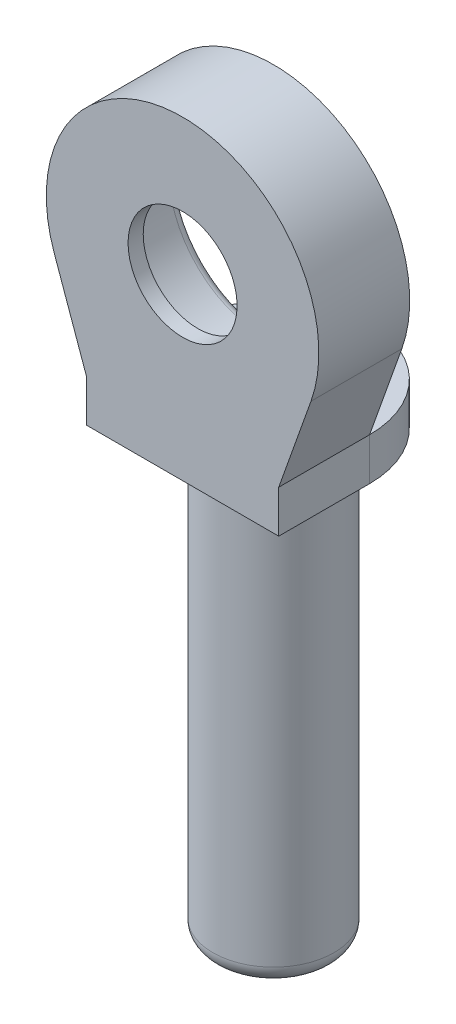
ISO-10303-21;
HEADER;
FILE_DESCRIPTION(('STEP AP214'),'2;1');
FILE_NAME('part.step','',(''),(''),'','','');
FILE_SCHEMA(('AUTOMOTIVE_DESIGN { 1 0 10303 214 1 1 1 1 }'));
ENDSEC;
DATA;
#1=APPLICATION_CONTEXT('core data for automotive mechanical design processes');
#2=APPLICATION_PROTOCOL_DEFINITION('international standard','automotive_design',2000,#1);
#3=PRODUCT_CONTEXT('',#1,'mechanical');
#4=PRODUCT('Part','Part','',(#3));
#5=PRODUCT_RELATED_PRODUCT_CATEGORY('part','',(#4));
#6=PRODUCT_DEFINITION_FORMATION('','',#4);
#7=PRODUCT_DEFINITION_CONTEXT('part definition',#1,'design');
#8=PRODUCT_DEFINITION('design','',#6,#7);
#9=PRODUCT_DEFINITION_SHAPE('','',#8);
#10=(LENGTH_UNIT() NAMED_UNIT(*) SI_UNIT(.MILLI.,.METRE.));
#11=(NAMED_UNIT(*) PLANE_ANGLE_UNIT() SI_UNIT($,.RADIAN.));
#12=(NAMED_UNIT(*) SI_UNIT($,.STERADIAN.) SOLID_ANGLE_UNIT());
#13=UNCERTAINTY_MEASURE_WITH_UNIT(LENGTH_MEASURE(1.E-05),#10,'distance_accuracy_value','');
#14=(GEOMETRIC_REPRESENTATION_CONTEXT(3) GLOBAL_UNCERTAINTY_ASSIGNED_CONTEXT((#13)) GLOBAL_UNIT_ASSIGNED_CONTEXT((#10,
#11,#12)) REPRESENTATION_CONTEXT('',''));
#15=CARTESIAN_POINT('',(0.,0.,0.));
#16=DIRECTION('',(0.,0.,1.));
#17=DIRECTION('',(1.,0.,0.));
#18=AXIS2_PLACEMENT_3D('',#15,#16,#17);
#19=CARTESIAN_POINT('',(-3.175,14.6,-9.5486743108979));
#20=DIRECTION('',(0.,-1.,0.));
#21=DIRECTION('',(0.,0.,-1.));
#22=AXIS2_PLACEMENT_3D('',#19,#20,#21);
#23=PLANE('',#22);
#24=DIRECTION('',(-1.,0.,0.));
#25=VECTOR('',#24,1.);
#26=CARTESIAN_POINT('',(-3.175,14.6,0.5));
#27=LINE('',#26,#25);
#28=CARTESIAN_POINT('',(1.3076696830622,14.6,0.5));
#29=VERTEX_POINT('',#28);
#30=CARTESIAN_POINT('',(-1.3076696830622,14.6,0.5));
#31=VERTEX_POINT('',#30);
#32=EDGE_CURVE('E124',#29,#31,#27,.T.);
#33=ORIENTED_EDGE('',*,*,#32,.T.);
#34=CARTESIAN_POINT('',(0.,14.6,0.));
#35=DIRECTION('',(0.,-1.,0.));
#36=DIRECTION('',(0.,0.,-1.));
#37=AXIS2_PLACEMENT_3D('',#34,#35,#36);
#38=CIRCLE('',#37,1.4);
#39=CARTESIAN_POINT('',(-1.4,14.6,0.));
#40=VERTEX_POINT('',#39);
#41=EDGE_CURVE('E215',#31,#40,#38,.T.);
#42=ORIENTED_EDGE('',*,*,#41,.T.);
#43=DIRECTION('',(1.,0.,0.));
#44=VECTOR('',#43,1.);
#45=CARTESIAN_POINT('',(-3.175,14.6,0.));
#46=LINE('',#45,#44);
#47=CARTESIAN_POINT('',(1.4,14.6,0.));
#48=VERTEX_POINT('',#47);
#49=EDGE_CURVE('E170',#40,#48,#46,.T.);
#50=ORIENTED_EDGE('',*,*,#49,.T.);
#51=EDGE_CURVE('E212',#48,#29,#38,.T.);
#52=ORIENTED_EDGE('',*,*,#51,.T.);
#53=EDGE_LOOP('',(#33,#42,#50,#52));
#54=FACE_BOUND('',#53,.T.);
#55=ADVANCED_FACE('F34',(#54),#23,.T.);
#56=CARTESIAN_POINT('',(0.,20.5,3.));
#57=DIRECTION('',(0.,0.,-1.));
#58=DIRECTION('',(-1.,0.,0.));
#59=AXIS2_PLACEMENT_3D('',#56,#57,#58);
#60=CYLINDRICAL_SURFACE('',#59,4.5);
#61=CARTESIAN_POINT('',(0.,20.5,3.));
#62=DIRECTION('',(0.,0.,1.));
#63=DIRECTION('',(-1.,0.,0.));
#64=AXIS2_PLACEMENT_3D('',#61,#62,#63);
#65=CIRCLE('',#64,4.5);
#66=CARTESIAN_POINT('',(4.23952688083414,18.9912217436996,3.));
#67=VERTEX_POINT('',#66);
#68=CARTESIAN_POINT('',(-4.23952688083414,18.9912217436996,3.));
#69=VERTEX_POINT('',#68);
#70=EDGE_CURVE('E49',#67,#69,#65,.T.);
#71=ORIENTED_EDGE('',*,*,#70,.F.);
#72=DIRECTION('',(0.,0.,1.));
#73=VECTOR('',#72,1.);
#74=CARTESIAN_POINT('',(4.23952688083414,18.9912217436996,-9.5486743108979));
#75=LINE('',#74,#73);
#76=CARTESIAN_POINT('',(4.23952688083414,18.9912217436996,0.));
#77=VERTEX_POINT('',#76);
#78=EDGE_CURVE('E195',#77,#67,#75,.T.);
#79=ORIENTED_EDGE('',*,*,#78,.F.);
#80=CARTESIAN_POINT('',(0.,20.5,0.));
#81=DIRECTION('',(0.,0.,1.));
#82=DIRECTION('',(1.,0.,0.));
#83=AXIS2_PLACEMENT_3D('',#80,#81,#82);
#84=CIRCLE('',#83,4.5);
#85=CARTESIAN_POINT('',(-4.23952688083414,18.9912217436996,0.));
#86=VERTEX_POINT('',#85);
#87=EDGE_CURVE('E210',#77,#86,#84,.T.);
#88=ORIENTED_EDGE('',*,*,#87,.T.);
#89=DIRECTION('',(0.,0.,1.));
#90=VECTOR('',#89,1.);
#91=CARTESIAN_POINT('',(-4.23952688083414,18.9912217436996,-9.5486743108979));
#92=LINE('',#91,#90);
#93=EDGE_CURVE('E54',#86,#69,#92,.T.);
#94=ORIENTED_EDGE('',*,*,#93,.T.);
#95=EDGE_LOOP('',(#71,#79,#88,#94));
#96=FACE_BOUND('',#95,.T.);
#97=ADVANCED_FACE('F241',(#96),#60,.T.);
#98=CARTESIAN_POINT('',(0.,20.5,3.));
#99=DIRECTION('',(0.,0.,-1.));
#100=DIRECTION('',(-1.,0.,0.));
#101=AXIS2_PLACEMENT_3D('',#98,#99,#100);
#102=PLANE('',#101);
#103=DIRECTION('',(1.,0.,0.));
#104=VECTOR('',#103,1.);
#105=CARTESIAN_POINT('',(-3.175,14.6,3.));
#106=LINE('',#105,#104);
#107=CARTESIAN_POINT('',(-3.175,14.6,3.));
#108=VERTEX_POINT('',#107);
#109=CARTESIAN_POINT('',(3.175,14.6,3.));
#110=VERTEX_POINT('',#109);
#111=EDGE_CURVE('E177',#108,#110,#106,.T.);
#112=ORIENTED_EDGE('',*,*,#111,.T.);
#113=DIRECTION('',(0.,1.,0.));
#114=VECTOR('',#113,1.);
#115=CARTESIAN_POINT('',(3.175,14.6,3.));
#116=LINE('',#115,#114);
#117=CARTESIAN_POINT('',(3.175,16.,3.));
#118=VERTEX_POINT('',#117);
#119=EDGE_CURVE('E174',#110,#118,#116,.T.);
#120=ORIENTED_EDGE('',*,*,#119,.T.);
#121=DIRECTION('',(0.335284056955635,0.942117084629809,0.));
#122=VECTOR('',#121,1.);
#123=CARTESIAN_POINT('',(3.175,16.,3.));
#124=LINE('',#123,#122);
#125=EDGE_CURVE('E171',#118,#67,#124,.T.);
#126=ORIENTED_EDGE('',*,*,#125,.T.);
#127=ORIENTED_EDGE('',*,*,#70,.T.);
#128=DIRECTION('',(0.335284056955635,-0.942117084629809,0.));
#129=VECTOR('',#128,1.);
#130=CARTESIAN_POINT('',(-3.175,16.,3.));
#131=LINE('',#130,#129);
#132=CARTESIAN_POINT('',(-3.175,16.,3.));
#133=VERTEX_POINT('',#132);
#134=EDGE_CURVE('E167',#69,#133,#131,.T.);
#135=ORIENTED_EDGE('',*,*,#134,.T.);
#136=DIRECTION('',(0.,-1.,0.));
#137=VECTOR('',#136,1.);
#138=CARTESIAN_POINT('',(-3.175,16.,3.));
#139=LINE('',#138,#137);
#140=EDGE_CURVE('E166',#133,#108,#139,.T.);
#141=ORIENTED_EDGE('',*,*,#140,.T.);
#142=EDGE_LOOP('',(#112,#120,#126,#127,#135,#141));
#143=FACE_BOUND('',#142,.T.);
#144=CARTESIAN_POINT('',(0.,20.5,3.));
#145=DIRECTION('',(0.,0.,-1.));
#146=DIRECTION('',(-1.,0.,0.));
#147=AXIS2_PLACEMENT_3D('',#144,#145,#146);
#148=CIRCLE('',#147,1.8);
#149=CARTESIAN_POINT('',(-1.8,20.5,3.));
#150=VERTEX_POINT('',#149);
#151=EDGE_CURVE('E128',#150,#150,#148,.F.);
#152=ORIENTED_EDGE('',*,*,#151,.F.);
#153=EDGE_LOOP('',(#152));
#154=FACE_BOUND('',#153,.T.);
#155=ADVANCED_FACE('F248',(#143,#154),#102,.F.);
#156=CARTESIAN_POINT('',(0.,20.5,0.));
#157=DIRECTION('',(0.,0.,-1.));
#158=DIRECTION('',(-1.,0.,0.));
#159=AXIS2_PLACEMENT_3D('',#156,#157,#158);
#160=PLANE('',#159);
#161=CARTESIAN_POINT('',(0.,20.5,0.));
#162=DIRECTION('',(0.,0.,-1.));
#163=DIRECTION('',(-1.,0.,0.));
#164=AXIS2_PLACEMENT_3D('',#161,#162,#163);
#165=CIRCLE('',#164,3.45);
#166=CARTESIAN_POINT('',(-3.45,20.5,0.));
#167=VERTEX_POINT('',#166);
#168=EDGE_CURVE('E11',#167,#167,#165,.F.);
#169=ORIENTED_EDGE('',*,*,#168,.T.);
#170=EDGE_LOOP('',(#169));
#171=FACE_BOUND('',#170,.T.);
#172=DIRECTION('',(1.,0.,0.));
#173=VECTOR('',#172,1.);
#174=CARTESIAN_POINT('',(0.,16.,0.));
#175=LINE('',#174,#173);
#176=CARTESIAN_POINT('',(-3.175,16.,0.));
#177=VERTEX_POINT('',#176);
#178=CARTESIAN_POINT('',(-2.4,16.,0.));
#179=VERTEX_POINT('',#178);
#180=EDGE_CURVE('E159',#177,#179,#175,.T.);
#181=ORIENTED_EDGE('',*,*,#180,.F.);
#182=DIRECTION('',(0.335284056955635,-0.942117084629809,0.));
#183=VECTOR('',#182,1.);
#184=CARTESIAN_POINT('',(-3.175,16.,0.));
#185=LINE('',#184,#183);
#186=EDGE_CURVE('E189',#86,#177,#185,.T.);
#187=ORIENTED_EDGE('',*,*,#186,.F.);
#188=ORIENTED_EDGE('',*,*,#87,.F.);
#189=DIRECTION('',(0.335284056955635,0.942117084629809,0.));
#190=VECTOR('',#189,1.);
#191=CARTESIAN_POINT('',(3.175,16.,0.));
#192=LINE('',#191,#190);
#193=CARTESIAN_POINT('',(3.175,16.,0.));
#194=VERTEX_POINT('',#193);
#195=EDGE_CURVE('E192',#194,#77,#192,.T.);
#196=ORIENTED_EDGE('',*,*,#195,.F.);
#197=CARTESIAN_POINT('',(2.4,16.,0.));
#198=VERTEX_POINT('',#197);
#199=EDGE_CURVE('E157',#198,#194,#175,.T.);
#200=ORIENTED_EDGE('',*,*,#199,.F.);
#201=CARTESIAN_POINT('',(2.4,15.,0.));
#202=DIRECTION('',(0.,0.,-1.));
#203=DIRECTION('',(-1.,0.,0.));
#204=AXIS2_PLACEMENT_3D('',#201,#202,#203);
#205=CIRCLE('',#204,1.);
#206=CARTESIAN_POINT('',(1.4,15.,0.));
#207=VERTEX_POINT('',#206);
#208=EDGE_CURVE('E217',#207,#198,#205,.T.);
#209=ORIENTED_EDGE('',*,*,#208,.F.);
#210=DIRECTION('',(0.,-1.,0.));
#211=VECTOR('',#210,1.);
#212=CARTESIAN_POINT('',(1.4,25.,0.));
#213=LINE('',#212,#211);
#214=EDGE_CURVE('E160',#207,#48,#213,.T.);
#215=ORIENTED_EDGE('',*,*,#214,.T.);
#216=ORIENTED_EDGE('',*,*,#49,.F.);
#217=DIRECTION('',(0.,-1.,0.));
#218=VECTOR('',#217,1.);
#219=CARTESIAN_POINT('',(-1.4,25.,0.));
#220=LINE('',#219,#218);
#221=CARTESIAN_POINT('',(-1.4,15.,0.));
#222=VERTEX_POINT('',#221);
#223=EDGE_CURVE('E163',#40,#222,#220,.F.);
#224=ORIENTED_EDGE('',*,*,#223,.T.);
#225=CARTESIAN_POINT('',(-2.4,15.,0.));
#226=DIRECTION('',(0.,0.,-1.));
#227=DIRECTION('',(-1.,0.,0.));
#228=AXIS2_PLACEMENT_3D('',#225,#226,#227);
#229=CIRCLE('',#228,1.);
#230=EDGE_CURVE('E219',#179,#222,#229,.T.);
#231=ORIENTED_EDGE('',*,*,#230,.F.);
#232=EDGE_LOOP('',(#181,#187,#188,#196,#200,#209,#215,#216,#224,#231));
#233=FACE_BOUND('',#232,.T.);
#234=ADVANCED_FACE('F317',(#171,#233),#160,.T.);
#235=CARTESIAN_POINT('',(0.,20.5,2.5));
#236=DIRECTION('',(0.,0.,-1.));
#237=DIRECTION('',(-1.,0.,0.));
#238=AXIS2_PLACEMENT_3D('',#235,#236,#237);
#239=CYLINDRICAL_SURFACE('',#238,3.15);
#240=CARTESIAN_POINT('',(0.,20.5,0.3));
#241=DIRECTION('',(0.,0.,-1.));
#242=DIRECTION('',(-1.,0.,0.));
#243=AXIS2_PLACEMENT_3D('',#240,#241,#242);
#244=CIRCLE('',#243,3.15);
#245=CARTESIAN_POINT('',(-3.15,20.5,0.3));
#246=VERTEX_POINT('',#245);
#247=EDGE_CURVE('E42',#246,#246,#244,.T.);
#248=ORIENTED_EDGE('',*,*,#247,.T.);
#249=EDGE_LOOP('',(#248));
#250=FACE_BOUND('',#249,.T.);
#251=CARTESIAN_POINT('',(0.,20.5,2.5));
#252=DIRECTION('',(0.,0.,-1.));
#253=DIRECTION('',(-1.,0.,0.));
#254=AXIS2_PLACEMENT_3D('',#251,#252,#253);
#255=CIRCLE('',#254,3.15);
#256=CARTESIAN_POINT('',(-3.15,20.5,2.5));
#257=VERTEX_POINT('',#256);
#258=EDGE_CURVE('E207',#257,#257,#255,.T.);
#259=ORIENTED_EDGE('',*,*,#258,.F.);
#260=EDGE_LOOP('',(#259));
#261=FACE_BOUND('',#260,.T.);
#262=ADVANCED_FACE('F223',(#250,#261),#239,.F.);
#263=CARTESIAN_POINT('',(0.,20.5,2.5));
#264=DIRECTION('',(0.,0.,-1.));
#265=DIRECTION('',(-1.,0.,0.));
#266=AXIS2_PLACEMENT_3D('',#263,#264,#265);
#267=PLANE('',#266);
#268=CARTESIAN_POINT('',(0.,20.5,2.5));
#269=DIRECTION('',(0.,0.,-1.));
#270=DIRECTION('',(-1.,0.,0.));
#271=AXIS2_PLACEMENT_3D('',#268,#269,#270);
#272=CIRCLE('',#271,1.8);
#273=CARTESIAN_POINT('',(-1.8,20.5,2.5));
#274=VERTEX_POINT('',#273);
#275=EDGE_CURVE('E310',#274,#274,#272,.T.);
#276=ORIENTED_EDGE('',*,*,#275,.F.);
#277=EDGE_LOOP('',(#276));
#278=FACE_BOUND('',#277,.T.);
#279=ORIENTED_EDGE('',*,*,#258,.T.);
#280=EDGE_LOOP('',(#279));
#281=FACE_BOUND('',#280,.T.);
#282=ADVANCED_FACE('F253',(#278,#281),#267,.T.);
#283=DIRECTION('',(0.,0.,1.));
#284=VECTOR('',#283,1.);
#285=CARTESIAN_POINT('',(3.175,14.6,-9.5486743108979));
#286=LINE('',#285,#284);
#287=CARTESIAN_POINT('',(3.175,14.6,0.));
#288=VERTEX_POINT('',#287);
#289=EDGE_CURVE('E183',#288,#110,#286,.T.);
#290=ORIENTED_EDGE('',*,*,#289,.T.);
#291=ORIENTED_EDGE('',*,*,#111,.F.);
#292=DIRECTION('',(0.,0.,1.));
#293=VECTOR('',#292,1.);
#294=CARTESIAN_POINT('',(-3.175,14.6,-9.5486743108979));
#295=LINE('',#294,#293);
#296=CARTESIAN_POINT('',(-3.175,14.6,0.));
#297=VERTEX_POINT('',#296);
#298=EDGE_CURVE('E187',#297,#108,#295,.T.);
#299=ORIENTED_EDGE('',*,*,#298,.F.);
#300=CARTESIAN_POINT('',(0.,14.6,0.));
#301=DIRECTION('',(0.,1.,0.));
#302=DIRECTION('',(0.,0.,1.));
#303=AXIS2_PLACEMENT_3D('',#300,#301,#302);
#304=CIRCLE('',#303,3.175);
#305=EDGE_CURVE('E147',#288,#297,#304,.T.);
#306=ORIENTED_EDGE('',*,*,#305,.F.);
#307=EDGE_LOOP('',(#290,#291,#299,#306));
#308=FACE_BOUND('',#307,.T.);
#309=CARTESIAN_POINT('',(0.,14.6,0.));
#310=DIRECTION('',(0.,1.,0.));
#311=DIRECTION('',(0.,0.,1.));
#312=AXIS2_PLACEMENT_3D('',#309,#310,#311);
#313=CIRCLE('',#312,2.);
#314=CARTESIAN_POINT('',(0.,14.6,2.));
#315=VERTEX_POINT('',#314);
#316=EDGE_CURVE('E135',#315,#315,#313,.T.);
#317=ORIENTED_EDGE('',*,*,#316,.T.);
#318=EDGE_LOOP('',(#317));
#319=FACE_BOUND('',#318,.T.);
#320=ADVANCED_FACE('F244',(#308,#319),#23,.T.);
#321=CARTESIAN_POINT('',(3.175,14.6,-9.5486743108979));
#322=DIRECTION('',(1.,0.,0.));
#323=DIRECTION('',(0.,0.,-1.));
#324=AXIS2_PLACEMENT_3D('',#321,#322,#323);
#325=PLANE('',#324);
#326=ORIENTED_EDGE('',*,*,#289,.F.);
#327=DIRECTION('',(0.,1.,0.));
#328=VECTOR('',#327,1.);
#329=CARTESIAN_POINT('',(3.175,14.6,0.));
#330=LINE('',#329,#328);
#331=EDGE_CURVE('E197',#288,#194,#330,.T.);
#332=ORIENTED_EDGE('',*,*,#331,.T.);
#333=DIRECTION('',(0.,0.,1.));
#334=VECTOR('',#333,1.);
#335=CARTESIAN_POINT('',(3.175,16.,-9.5486743108979));
#336=LINE('',#335,#334);
#337=EDGE_CURVE('E196',#194,#118,#336,.T.);
#338=ORIENTED_EDGE('',*,*,#337,.T.);
#339=ORIENTED_EDGE('',*,*,#119,.F.);
#340=EDGE_LOOP('',(#326,#332,#338,#339));
#341=FACE_BOUND('',#340,.T.);
#342=ADVANCED_FACE('F252',(#341),#325,.T.);
#343=CARTESIAN_POINT('',(3.175,16.,-9.5486743108979));
#344=DIRECTION('',(0.942117084629809,-0.335284056955635,0.));
#345=DIRECTION('',(0.335284056955635,0.942117084629809,0.));
#346=AXIS2_PLACEMENT_3D('',#343,#344,#345);
#347=PLANE('',#346);
#348=ORIENTED_EDGE('',*,*,#337,.F.);
#349=ORIENTED_EDGE('',*,*,#195,.T.);
#350=ORIENTED_EDGE('',*,*,#78,.T.);
#351=ORIENTED_EDGE('',*,*,#125,.F.);
#352=EDGE_LOOP('',(#348,#349,#350,#351));
#353=FACE_BOUND('',#352,.T.);
#354=ADVANCED_FACE('F259',(#353),#347,.T.);
#355=CARTESIAN_POINT('',(-3.175,16.,-9.5486743108979));
#356=DIRECTION('',(-0.942117084629809,-0.335284056955635,0.));
#357=DIRECTION('',(0.335284056955635,-0.942117084629809,0.));
#358=AXIS2_PLACEMENT_3D('',#355,#356,#357);
#359=PLANE('',#358);
#360=ORIENTED_EDGE('',*,*,#93,.F.);
#361=ORIENTED_EDGE('',*,*,#186,.T.);
#362=DIRECTION('',(0.,0.,1.));
#363=VECTOR('',#362,1.);
#364=CARTESIAN_POINT('',(-3.175,16.,-9.5486743108979));
#365=LINE('',#364,#363);
#366=EDGE_CURVE('E188',#177,#133,#365,.T.);
#367=ORIENTED_EDGE('',*,*,#366,.T.);
#368=ORIENTED_EDGE('',*,*,#134,.F.);
#369=EDGE_LOOP('',(#360,#361,#367,#368));
#370=FACE_BOUND('',#369,.T.);
#371=ADVANCED_FACE('F289',(#370),#359,.T.);
#372=CARTESIAN_POINT('',(-3.175,16.,-9.5486743108979));
#373=DIRECTION('',(-1.,0.,0.));
#374=DIRECTION('',(0.,0.,1.));
#375=AXIS2_PLACEMENT_3D('',#372,#373,#374);
#376=PLANE('',#375);
#377=ORIENTED_EDGE('',*,*,#366,.F.);
#378=DIRECTION('',(0.,-1.,0.));
#379=VECTOR('',#378,1.);
#380=CARTESIAN_POINT('',(-3.175,16.,0.));
#381=LINE('',#380,#379);
#382=EDGE_CURVE('E184',#177,#297,#381,.T.);
#383=ORIENTED_EDGE('',*,*,#382,.T.);
#384=ORIENTED_EDGE('',*,*,#298,.T.);
#385=ORIENTED_EDGE('',*,*,#140,.F.);
#386=EDGE_LOOP('',(#377,#383,#384,#385));
#387=FACE_BOUND('',#386,.T.);
#388=ADVANCED_FACE('F285',(#387),#376,.T.);
#389=CARTESIAN_POINT('',(0.,15.,0.));
#390=DIRECTION('',(0.,1.,0.));
#391=DIRECTION('',(0.,0.,1.));
#392=AXIS2_PLACEMENT_3D('',#389,#390,#391);
#393=TOROIDAL_SURFACE('',#392,2.4,1.);
#394=CARTESIAN_POINT('',(0.,16.,0.));
#395=DIRECTION('',(0.,1.,0.));
#396=DIRECTION('',(0.,0.,1.));
#397=AXIS2_PLACEMENT_3D('',#394,#395,#396);
#398=CIRCLE('',#397,2.4);
#399=EDGE_CURVE('E154',#179,#198,#398,.F.);
#400=ORIENTED_EDGE('',*,*,#399,.F.);
#401=ORIENTED_EDGE('',*,*,#230,.T.);
#402=CARTESIAN_POINT('',(0.,15.,0.));
#403=DIRECTION('',(0.,1.,0.));
#404=DIRECTION('',(0.,0.,1.));
#405=AXIS2_PLACEMENT_3D('',#402,#403,#404);
#406=CIRCLE('',#405,1.4);
#407=EDGE_CURVE('E151',#207,#222,#406,.T.);
#408=ORIENTED_EDGE('',*,*,#407,.F.);
#409=ORIENTED_EDGE('',*,*,#208,.T.);
#410=EDGE_LOOP('',(#400,#401,#408,#409));
#411=FACE_BOUND('',#410,.T.);
#412=ADVANCED_FACE('F282',(#411),#393,.T.);
#413=CARTESIAN_POINT('',(0.,25.,0.));
#414=DIRECTION('',(0.,-1.,0.));
#415=DIRECTION('',(0.,0.,-1.));
#416=AXIS2_PLACEMENT_3D('',#413,#414,#415);
#417=CYLINDRICAL_SURFACE('',#416,1.4);
#418=ORIENTED_EDGE('',*,*,#223,.F.);
#419=ORIENTED_EDGE('',*,*,#41,.F.);
#420=DIRECTION('',(0.,-1.,0.));
#421=VECTOR('',#420,1.);
#422=CARTESIAN_POINT('',(-1.3076696830622,25.,0.5));
#423=LINE('',#422,#421);
#424=CARTESIAN_POINT('',(-1.3076696830622,0.,0.5));
#425=VERTEX_POINT('',#424);
#426=EDGE_CURVE('E127',#31,#425,#423,.T.);
#427=ORIENTED_EDGE('',*,*,#426,.T.);
#428=CARTESIAN_POINT('',(0.,0.,0.));
#429=DIRECTION('',(0.,-1.,0.));
#430=DIRECTION('',(0.,0.,-1.));
#431=AXIS2_PLACEMENT_3D('',#428,#429,#430);
#432=CIRCLE('',#431,1.4);
#433=CARTESIAN_POINT('',(1.3076696830622,0.,0.5));
#434=VERTEX_POINT('',#433);
#435=EDGE_CURVE('E131',#425,#434,#432,.T.);
#436=ORIENTED_EDGE('',*,*,#435,.T.);
#437=DIRECTION('',(0.,-1.,0.));
#438=VECTOR('',#437,1.);
#439=CARTESIAN_POINT('',(1.3076696830622,25.,0.5));
#440=LINE('',#439,#438);
#441=EDGE_CURVE('E116',#29,#434,#440,.T.);
#442=ORIENTED_EDGE('',*,*,#441,.F.);
#443=ORIENTED_EDGE('',*,*,#51,.F.);
#444=ORIENTED_EDGE('',*,*,#214,.F.);
#445=ORIENTED_EDGE('',*,*,#407,.T.);
#446=EDGE_LOOP('',(#418,#419,#427,#436,#442,#443,#444,#445));
#447=FACE_BOUND('',#446,.T.);
#448=ADVANCED_FACE('F132',(#447),#417,.F.);
#449=CARTESIAN_POINT('',(-1.3076696830622,25.,0.5));
#450=DIRECTION('',(0.,0.,1.));
#451=DIRECTION('',(1.,0.,0.));
#452=AXIS2_PLACEMENT_3D('',#449,#450,#451);
#453=PLANE('',#452);
#454=ORIENTED_EDGE('',*,*,#32,.F.);
#455=ORIENTED_EDGE('',*,*,#441,.T.);
#456=DIRECTION('',(1.,0.,0.));
#457=VECTOR('',#456,1.);
#458=CARTESIAN_POINT('',(-1.3076696830622,0.,0.5));
#459=LINE('',#458,#457);
#460=EDGE_CURVE('E121',#434,#425,#459,.F.);
#461=ORIENTED_EDGE('',*,*,#460,.T.);
#462=ORIENTED_EDGE('',*,*,#426,.F.);
#463=EDGE_LOOP('',(#454,#455,#461,#462));
#464=FACE_BOUND('',#463,.T.);
#465=ADVANCED_FACE('F118',(#464),#453,.F.);
#466=CARTESIAN_POINT('',(0.,16.,0.));
#467=DIRECTION('',(0.,1.,0.));
#468=DIRECTION('',(0.,0.,1.));
#469=AXIS2_PLACEMENT_3D('',#466,#467,#468);
#470=PLANE('',#469);
#471=CARTESIAN_POINT('',(0.,16.,0.));
#472=DIRECTION('',(0.,1.,0.));
#473=DIRECTION('',(0.,0.,1.));
#474=AXIS2_PLACEMENT_3D('',#471,#472,#473);
#475=CIRCLE('',#474,3.175);
#476=EDGE_CURVE('E140',#194,#177,#475,.T.);
#477=ORIENTED_EDGE('',*,*,#476,.T.);
#478=ORIENTED_EDGE('',*,*,#180,.T.);
#479=ORIENTED_EDGE('',*,*,#399,.T.);
#480=ORIENTED_EDGE('',*,*,#199,.T.);
#481=EDGE_LOOP('',(#477,#478,#479,#480));
#482=FACE_BOUND('',#481,.T.);
#483=ADVANCED_FACE('F281',(#482),#470,.T.);
#484=CARTESIAN_POINT('',(0.,0.6,0.));
#485=DIRECTION('',(0.,1.,0.));
#486=DIRECTION('',(0.,0.,1.));
#487=AXIS2_PLACEMENT_3D('',#484,#485,#486);
#488=TOROIDAL_SURFACE('',#487,1.4,0.6);
#489=ORIENTED_EDGE('',*,*,#435,.F.);
#490=CARTESIAN_POINT('',(0.,0.,0.));
#491=DIRECTION('',(0.,1.,0.));
#492=DIRECTION('',(0.,0.,1.));
#493=AXIS2_PLACEMENT_3D('',#490,#491,#492);
#494=CIRCLE('',#493,1.4);
#495=EDGE_CURVE('E136',#434,#425,#494,.F.);
#496=ORIENTED_EDGE('',*,*,#495,.F.);
#497=EDGE_LOOP('',(#489,#496));
#498=FACE_BOUND('',#497,.T.);
#499=CARTESIAN_POINT('',(0.,0.6,0.));
#500=DIRECTION('',(0.,1.,0.));
#501=DIRECTION('',(0.,0.,1.));
#502=AXIS2_PLACEMENT_3D('',#499,#500,#501);
#503=CIRCLE('',#502,2.);
#504=CARTESIAN_POINT('',(0.,0.6,2.));
#505=VERTEX_POINT('',#504);
#506=EDGE_CURVE('E144',#505,#505,#503,.T.);
#507=ORIENTED_EDGE('',*,*,#506,.F.);
#508=EDGE_LOOP('',(#507));
#509=FACE_BOUND('',#508,.T.);
#510=ADVANCED_FACE('F142',(#498,#509),#488,.T.);
#511=CARTESIAN_POINT('',(0.,0.,0.));
#512=DIRECTION('',(0.,1.,0.));
#513=DIRECTION('',(0.,0.,1.));
#514=AXIS2_PLACEMENT_3D('',#511,#512,#513);
#515=PLANE('',#514);
#516=ORIENTED_EDGE('',*,*,#495,.T.);
#517=ORIENTED_EDGE('',*,*,#460,.F.);
#518=EDGE_LOOP('',(#516,#517));
#519=FACE_BOUND('',#518,.T.);
#520=ADVANCED_FACE('F139',(#519),#515,.F.);
#521=CARTESIAN_POINT('',(0.,16.,0.));
#522=DIRECTION('',(0.,-1.,0.));
#523=DIRECTION('',(0.,0.,-1.));
#524=AXIS2_PLACEMENT_3D('',#521,#522,#523);
#525=CYLINDRICAL_SURFACE('',#524,2.);
#526=ORIENTED_EDGE('',*,*,#506,.T.);
#527=EDGE_LOOP('',(#526));
#528=FACE_BOUND('',#527,.T.);
#529=ORIENTED_EDGE('',*,*,#316,.F.);
#530=EDGE_LOOP('',(#529));
#531=FACE_BOUND('',#530,.T.);
#532=ADVANCED_FACE('F236',(#528,#531),#525,.T.);
#533=CARTESIAN_POINT('',(0.,14.6,0.));
#534=DIRECTION('',(0.,1.,0.));
#535=DIRECTION('',(0.,0.,1.));
#536=AXIS2_PLACEMENT_3D('',#533,#534,#535);
#537=CYLINDRICAL_SURFACE('',#536,3.175);
#538=ORIENTED_EDGE('',*,*,#331,.F.);
#539=ORIENTED_EDGE('',*,*,#305,.T.);
#540=ORIENTED_EDGE('',*,*,#382,.F.);
#541=ORIENTED_EDGE('',*,*,#476,.F.);
#542=EDGE_LOOP('',(#538,#539,#540,#541));
#543=FACE_BOUND('',#542,.T.);
#544=ADVANCED_FACE('F228',(#543),#537,.T.);
#545=CARTESIAN_POINT('',(0.,20.5,0.3));
#546=DIRECTION('',(0.,0.,-1.));
#547=DIRECTION('',(-1.,0.,0.));
#548=AXIS2_PLACEMENT_3D('',#545,#546,#547);
#549=TOROIDAL_SURFACE('',#548,3.45,0.3);
#550=ORIENTED_EDGE('',*,*,#168,.F.);
#551=EDGE_LOOP('',(#550));
#552=FACE_BOUND('',#551,.T.);
#553=ORIENTED_EDGE('',*,*,#247,.F.);
#554=EDGE_LOOP('',(#553));
#555=FACE_BOUND('',#554,.T.);
#556=ADVANCED_FACE('F36',(#552,#555),#549,.T.);
#557=CARTESIAN_POINT('',(0.,20.5,3.176));
#558=DIRECTION('',(0.,0.,-1.));
#559=DIRECTION('',(-1.,0.,0.));
#560=AXIS2_PLACEMENT_3D('',#557,#558,#559);
#561=CYLINDRICAL_SURFACE('',#560,1.8);
#562=ORIENTED_EDGE('',*,*,#275,.T.);
#563=EDGE_LOOP('',(#562));
#564=FACE_BOUND('',#563,.T.);
#565=ORIENTED_EDGE('',*,*,#151,.T.);
#566=EDGE_LOOP('',(#565));
#567=FACE_BOUND('',#566,.T.);
#568=ADVANCED_FACE('F227',(#564,#567),#561,.F.);
#569=CLOSED_SHELL('',(#55,#97,#155,#234,#262,#282,#320,#342,#354,#371,#388,#412,#448,#465,#483,
#510,#520,#532,#544,#556,#568));
#570=MANIFOLD_SOLID_BREP('B2',#569);
#571=ADVANCED_BREP_SHAPE_REPRESENTATION('',(#18,#570),#14);
#572=SHAPE_DEFINITION_REPRESENTATION(#9,#571);
ENDSEC;
END-ISO-10303-21;
